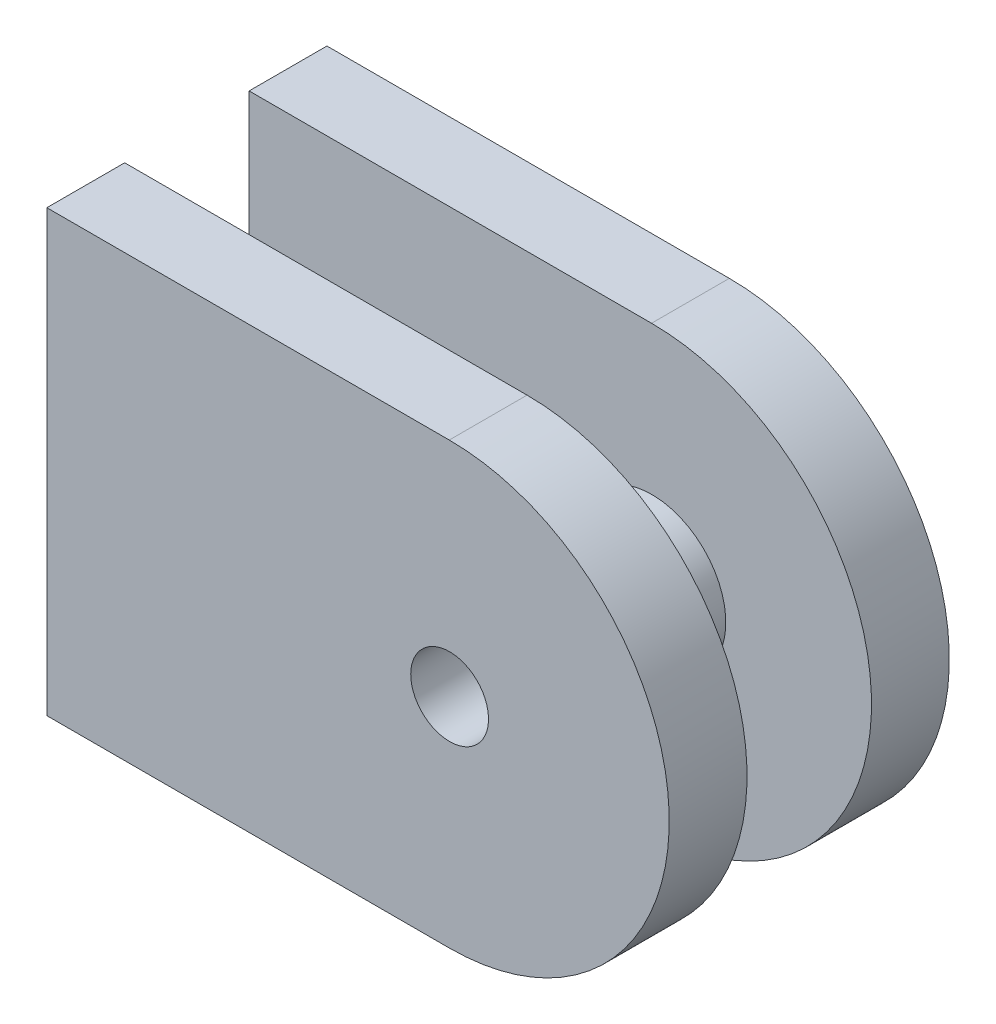
ISO-10303-21;
HEADER;
FILE_DESCRIPTION(('STEP AP214'),'2;1');
FILE_NAME('part.step','',(''),(''),'','','');
FILE_SCHEMA(('AUTOMOTIVE_DESIGN { 1 0 10303 214 1 1 1 1 }'));
ENDSEC;
DATA;
#1=APPLICATION_CONTEXT('core data for automotive mechanical design processes');
#2=APPLICATION_PROTOCOL_DEFINITION('international standard','automotive_design',2000,#1);
#3=PRODUCT_CONTEXT('',#1,'mechanical');
#4=PRODUCT('Part','Part','',(#3));
#5=PRODUCT_RELATED_PRODUCT_CATEGORY('part','',(#4));
#6=PRODUCT_DEFINITION_FORMATION('','',#4);
#7=PRODUCT_DEFINITION_CONTEXT('part definition',#1,'design');
#8=PRODUCT_DEFINITION('design','',#6,#7);
#9=PRODUCT_DEFINITION_SHAPE('','',#8);
#10=(LENGTH_UNIT() NAMED_UNIT(*) SI_UNIT(.MILLI.,.METRE.));
#11=(NAMED_UNIT(*) PLANE_ANGLE_UNIT() SI_UNIT($,.RADIAN.));
#12=(NAMED_UNIT(*) SI_UNIT($,.STERADIAN.) SOLID_ANGLE_UNIT());
#13=UNCERTAINTY_MEASURE_WITH_UNIT(LENGTH_MEASURE(1.E-05),#10,'distance_accuracy_value','');
#14=(GEOMETRIC_REPRESENTATION_CONTEXT(3) GLOBAL_UNCERTAINTY_ASSIGNED_CONTEXT((#13)) GLOBAL_UNIT_ASSIGNED_CONTEXT((#10,
#11,#12)) REPRESENTATION_CONTEXT('',''));
#15=CARTESIAN_POINT('',(0.,0.,0.));
#16=DIRECTION('',(0.,0.,1.));
#17=DIRECTION('',(1.,0.,0.));
#18=AXIS2_PLACEMENT_3D('',#15,#16,#17);
#19=CARTESIAN_POINT('',(0.,0.,5.));
#20=DIRECTION('',(1.,0.,0.));
#21=DIRECTION('',(0.,0.,-1.));
#22=AXIS2_PLACEMENT_3D('',#19,#20,#21);
#23=PLANE('',#22);
#24=DIRECTION('',(0.,-1.,0.));
#25=VECTOR('',#24,1.);
#26=CARTESIAN_POINT('',(0.,0.,5.));
#27=LINE('',#26,#25);
#28=CARTESIAN_POINT('',(0.,31.7713251901101,5.));
#29=VERTEX_POINT('',#28);
#30=CARTESIAN_POINT('',(0.,3.49668292914965,5.));
#31=VERTEX_POINT('',#30);
#32=EDGE_CURVE('E160',#29,#31,#27,.T.);
#33=ORIENTED_EDGE('',*,*,#32,.F.);
#34=DIRECTION('',(0.,0.,-1.));
#35=VECTOR('',#34,1.);
#36=CARTESIAN_POINT('',(0.,31.7713251901101,25.));
#37=LINE('',#36,#35);
#38=CARTESIAN_POINT('',(0.,31.7713251901101,0.));
#39=VERTEX_POINT('',#38);
#40=EDGE_CURVE('E131',#29,#39,#37,.T.);
#41=ORIENTED_EDGE('',*,*,#40,.T.);
#42=DIRECTION('',(0.,-1.,0.));
#43=VECTOR('',#42,1.);
#44=CARTESIAN_POINT('',(0.,0.,0.));
#45=LINE('',#44,#43);
#46=CARTESIAN_POINT('',(0.,3.49668292914966,0.));
#47=VERTEX_POINT('',#46);
#48=EDGE_CURVE('E159',#39,#47,#45,.T.);
#49=ORIENTED_EDGE('',*,*,#48,.T.);
#50=DIRECTION('',(0.,0.,-1.));
#51=VECTOR('',#50,1.);
#52=CARTESIAN_POINT('',(0.,3.49668292914965,25.));
#53=LINE('',#52,#51);
#54=EDGE_CURVE('E52',#31,#47,#53,.T.);
#55=ORIENTED_EDGE('',*,*,#54,.F.);
#56=EDGE_LOOP('',(#33,#41,#49,#55));
#57=FACE_BOUND('',#56,.T.);
#58=ADVANCED_FACE('F38',(#57),#23,.F.);
#59=CARTESIAN_POINT('',(0.,0.,5.));
#60=DIRECTION('',(0.,0.,-1.));
#61=DIRECTION('',(-1.,0.,0.));
#62=AXIS2_PLACEMENT_3D('',#59,#60,#61);
#63=PLANE('',#62);
#64=CARTESIAN_POINT('',(25.8853790283596,17.5,5.));
#65=DIRECTION('',(0.,0.,-1.));
#66=DIRECTION('',(-1.,0.,0.));
#67=AXIS2_PLACEMENT_3D('',#64,#65,#66);
#68=CIRCLE('',#67,4.75);
#69=CARTESIAN_POINT('',(21.1353790283596,17.5,5.));
#70=VERTEX_POINT('',#69);
#71=EDGE_CURVE('E163',#70,#70,#68,.F.);
#72=ORIENTED_EDGE('',*,*,#71,.F.);
#73=EDGE_LOOP('',(#72));
#74=FACE_BOUND('',#73,.T.);
#75=CARTESIAN_POINT('',(25.8626788695198,17.6340040596299,5.));
#76=DIRECTION('',(0.,0.,-1.));
#77=DIRECTION('',(-1.,0.,0.));
#78=AXIS2_PLACEMENT_3D('',#75,#76,#77);
#79=CIRCLE('',#78,14.1373211304802);
#80=CARTESIAN_POINT('',(25.8626788695198,3.49668292914966,5.));
#81=VERTEX_POINT('',#80);
#82=CARTESIAN_POINT('',(25.8626788695198,31.7713251901101,5.));
#83=VERTEX_POINT('',#82);
#84=EDGE_CURVE('E148',#81,#83,#79,.F.);
#85=ORIENTED_EDGE('',*,*,#84,.T.);
#86=DIRECTION('',(-1.,0.,0.));
#87=VECTOR('',#86,1.);
#88=CARTESIAN_POINT('',(0.,31.7713251901101,5.));
#89=LINE('',#88,#87);
#90=EDGE_CURVE('E113',#83,#29,#89,.T.);
#91=ORIENTED_EDGE('',*,*,#90,.T.);
#92=ORIENTED_EDGE('',*,*,#32,.T.);
#93=DIRECTION('',(1.,0.,0.));
#94=VECTOR('',#93,1.);
#95=CARTESIAN_POINT('',(0.,3.49668292914965,5.));
#96=LINE('',#95,#94);
#97=EDGE_CURVE('E139',#31,#81,#96,.T.);
#98=ORIENTED_EDGE('',*,*,#97,.T.);
#99=EDGE_LOOP('',(#85,#91,#92,#98));
#100=FACE_BOUND('',#99,.T.);
#101=ADVANCED_FACE('F194',(#74,#100),#63,.F.);
#102=CARTESIAN_POINT('',(0.,0.,0.));
#103=DIRECTION('',(0.,0.,-1.));
#104=DIRECTION('',(-1.,0.,0.));
#105=AXIS2_PLACEMENT_3D('',#102,#103,#104);
#106=PLANE('',#105);
#107=CARTESIAN_POINT('',(25.8853790283596,17.5,0.));
#108=DIRECTION('',(0.,0.,-1.));
#109=DIRECTION('',(-1.,0.,0.));
#110=AXIS2_PLACEMENT_3D('',#107,#108,#109);
#111=CIRCLE('',#110,2.5);
#112=CARTESIAN_POINT('',(23.3853790283596,17.5,0.));
#113=VERTEX_POINT('',#112);
#114=EDGE_CURVE('E225',#113,#113,#111,.T.);
#115=ORIENTED_EDGE('',*,*,#114,.F.);
#116=EDGE_LOOP('',(#115));
#117=FACE_BOUND('',#116,.T.);
#118=DIRECTION('',(-1.,0.,0.));
#119=VECTOR('',#118,1.);
#120=CARTESIAN_POINT('',(0.,31.7713251901101,0.));
#121=LINE('',#120,#119);
#122=CARTESIAN_POINT('',(25.8626788695198,31.7713251901101,0.));
#123=VERTEX_POINT('',#122);
#124=EDGE_CURVE('E143',#123,#39,#121,.T.);
#125=ORIENTED_EDGE('',*,*,#124,.F.);
#126=CARTESIAN_POINT('',(25.8626788695198,17.6340040596299,0.));
#127=DIRECTION('',(0.,0.,-1.));
#128=DIRECTION('',(-1.,0.,0.));
#129=AXIS2_PLACEMENT_3D('',#126,#127,#128);
#130=CIRCLE('',#129,14.1373211304802);
#131=CARTESIAN_POINT('',(25.8626788695198,3.49668292914966,0.));
#132=VERTEX_POINT('',#131);
#133=EDGE_CURVE('E112',#132,#123,#130,.F.);
#134=ORIENTED_EDGE('',*,*,#133,.F.);
#135=DIRECTION('',(1.,0.,0.));
#136=VECTOR('',#135,1.);
#137=CARTESIAN_POINT('',(0.,3.49668292914965,0.));
#138=LINE('',#137,#136);
#139=EDGE_CURVE('E118',#47,#132,#138,.T.);
#140=ORIENTED_EDGE('',*,*,#139,.F.);
#141=ORIENTED_EDGE('',*,*,#48,.F.);
#142=EDGE_LOOP('',(#125,#134,#140,#141));
#143=FACE_BOUND('',#142,.T.);
#144=ADVANCED_FACE('F199',(#117,#143),#106,.T.);
#145=CARTESIAN_POINT('',(25.8853790283596,17.5,13.));
#146=DIRECTION('',(0.,0.,-1.));
#147=DIRECTION('',(-1.,0.,0.));
#148=AXIS2_PLACEMENT_3D('',#145,#146,#147);
#149=CYLINDRICAL_SURFACE('',#148,4.75);
#150=CARTESIAN_POINT('',(25.8853790283596,17.5,13.));
#151=DIRECTION('',(0.,0.,1.));
#152=DIRECTION('',(1.,0.,0.));
#153=AXIS2_PLACEMENT_3D('',#150,#151,#152);
#154=CIRCLE('',#153,4.75);
#155=CARTESIAN_POINT('',(30.6353790283596,17.5,13.));
#156=VERTEX_POINT('',#155);
#157=EDGE_CURVE('E154',#156,#156,#154,.T.);
#158=ORIENTED_EDGE('',*,*,#157,.F.);
#159=EDGE_LOOP('',(#158));
#160=FACE_BOUND('',#159,.T.);
#161=ORIENTED_EDGE('',*,*,#71,.T.);
#162=EDGE_LOOP('',(#161));
#163=FACE_BOUND('',#162,.T.);
#164=ADVANCED_FACE('F228',(#160,#163),#149,.T.);
#165=CARTESIAN_POINT('',(0.,0.,13.));
#166=DIRECTION('',(1.,0.,0.));
#167=DIRECTION('',(0.,0.,1.));
#168=AXIS2_PLACEMENT_3D('',#165,#166,#167);
#169=PLANE('',#168);
#170=DIRECTION('',(0.,-1.,0.));
#171=VECTOR('',#170,1.);
#172=CARTESIAN_POINT('',(0.,0.,18.));
#173=LINE('',#172,#171);
#174=CARTESIAN_POINT('',(0.,31.7713251901101,18.));
#175=VERTEX_POINT('',#174);
#176=CARTESIAN_POINT('',(0.,3.49668292914965,18.));
#177=VERTEX_POINT('',#176);
#178=EDGE_CURVE('E151',#175,#177,#173,.T.);
#179=ORIENTED_EDGE('',*,*,#178,.F.);
#180=CARTESIAN_POINT('',(0.,31.7713251901101,13.));
#181=VERTEX_POINT('',#180);
#182=EDGE_CURVE('E134',#175,#181,#37,.T.);
#183=ORIENTED_EDGE('',*,*,#182,.T.);
#184=DIRECTION('',(0.,-1.,0.));
#185=VECTOR('',#184,1.);
#186=CARTESIAN_POINT('',(0.,0.,13.));
#187=LINE('',#186,#185);
#188=CARTESIAN_POINT('',(0.,3.49668292914965,13.));
#189=VERTEX_POINT('',#188);
#190=EDGE_CURVE('E152',#181,#189,#187,.T.);
#191=ORIENTED_EDGE('',*,*,#190,.T.);
#192=EDGE_CURVE('E117',#177,#189,#53,.T.);
#193=ORIENTED_EDGE('',*,*,#192,.F.);
#194=EDGE_LOOP('',(#179,#183,#191,#193));
#195=FACE_BOUND('',#194,.T.);
#196=ADVANCED_FACE('F172',(#195),#169,.F.);
#197=CARTESIAN_POINT('',(0.,0.,13.));
#198=DIRECTION('',(0.,0.,1.));
#199=DIRECTION('',(-1.,0.,0.));
#200=AXIS2_PLACEMENT_3D('',#197,#198,#199);
#201=PLANE('',#200);
#202=ORIENTED_EDGE('',*,*,#157,.T.);
#203=EDGE_LOOP('',(#202));
#204=FACE_BOUND('',#203,.T.);
#205=ORIENTED_EDGE('',*,*,#190,.F.);
#206=DIRECTION('',(1.,0.,0.));
#207=VECTOR('',#206,1.);
#208=CARTESIAN_POINT('',(0.,31.7713251901101,13.));
#209=LINE('',#208,#207);
#210=CARTESIAN_POINT('',(25.8626788695198,31.7713251901101,13.));
#211=VERTEX_POINT('',#210);
#212=EDGE_CURVE('E108',#181,#211,#209,.T.);
#213=ORIENTED_EDGE('',*,*,#212,.T.);
#214=CARTESIAN_POINT('',(25.8626788695198,17.6340040596299,13.));
#215=DIRECTION('',(0.,0.,1.));
#216=DIRECTION('',(1.,0.,0.));
#217=AXIS2_PLACEMENT_3D('',#214,#215,#216);
#218=CIRCLE('',#217,14.1373211304802);
#219=CARTESIAN_POINT('',(25.8626788695198,3.49668292914966,13.));
#220=VERTEX_POINT('',#219);
#221=EDGE_CURVE('E103',#211,#220,#218,.F.);
#222=ORIENTED_EDGE('',*,*,#221,.T.);
#223=DIRECTION('',(-1.,0.,0.));
#224=VECTOR('',#223,1.);
#225=CARTESIAN_POINT('',(0.,3.49668292914965,13.));
#226=LINE('',#225,#224);
#227=EDGE_CURVE('E106',#220,#189,#226,.T.);
#228=ORIENTED_EDGE('',*,*,#227,.T.);
#229=EDGE_LOOP('',(#205,#213,#222,#228));
#230=FACE_BOUND('',#229,.T.);
#231=ADVANCED_FACE('F105',(#204,#230),#201,.F.);
#232=CARTESIAN_POINT('',(0.,0.,18.));
#233=DIRECTION('',(0.,0.,1.));
#234=DIRECTION('',(-1.,0.,0.));
#235=AXIS2_PLACEMENT_3D('',#232,#233,#234);
#236=PLANE('',#235);
#237=CARTESIAN_POINT('',(25.8853790283596,17.5,18.));
#238=DIRECTION('',(0.,0.,-1.));
#239=DIRECTION('',(-1.,0.,0.));
#240=AXIS2_PLACEMENT_3D('',#237,#238,#239);
#241=CIRCLE('',#240,2.5);
#242=CARTESIAN_POINT('',(23.3853790283596,17.5,18.));
#243=VERTEX_POINT('',#242);
#244=EDGE_CURVE('E127',#243,#243,#241,.T.);
#245=ORIENTED_EDGE('',*,*,#244,.T.);
#246=EDGE_LOOP('',(#245));
#247=FACE_BOUND('',#246,.T.);
#248=DIRECTION('',(1.,0.,0.));
#249=VECTOR('',#248,1.);
#250=CARTESIAN_POINT('',(0.,31.7713251901101,18.));
#251=LINE('',#250,#249);
#252=CARTESIAN_POINT('',(25.8626788695198,31.7713251901101,18.));
#253=VERTEX_POINT('',#252);
#254=EDGE_CURVE('E12',#175,#253,#251,.T.);
#255=ORIENTED_EDGE('',*,*,#254,.F.);
#256=ORIENTED_EDGE('',*,*,#178,.T.);
#257=DIRECTION('',(-1.,0.,0.));
#258=VECTOR('',#257,1.);
#259=CARTESIAN_POINT('',(0.,3.49668292914965,18.));
#260=LINE('',#259,#258);
#261=CARTESIAN_POINT('',(25.8626788695198,3.49668292914966,18.));
#262=VERTEX_POINT('',#261);
#263=EDGE_CURVE('E168',#262,#177,#260,.T.);
#264=ORIENTED_EDGE('',*,*,#263,.F.);
#265=CARTESIAN_POINT('',(25.8626788695198,17.6340040596299,18.));
#266=DIRECTION('',(0.,0.,1.));
#267=DIRECTION('',(1.,0.,0.));
#268=AXIS2_PLACEMENT_3D('',#265,#266,#267);
#269=CIRCLE('',#268,14.1373211304802);
#270=EDGE_CURVE('E45',#253,#262,#269,.F.);
#271=ORIENTED_EDGE('',*,*,#270,.F.);
#272=EDGE_LOOP('',(#255,#256,#264,#271));
#273=FACE_BOUND('',#272,.T.);
#274=ADVANCED_FACE('F175',(#247,#273),#236,.T.);
#275=CARTESIAN_POINT('',(25.8626788695198,31.7713251901101,25.));
#276=DIRECTION('',(0.,-1.,0.));
#277=DIRECTION('',(0.,0.,-1.));
#278=AXIS2_PLACEMENT_3D('',#275,#276,#277);
#279=PLANE('',#278);
#280=ORIENTED_EDGE('',*,*,#182,.F.);
#281=ORIENTED_EDGE('',*,*,#254,.T.);
#282=DIRECTION('',(0.,0.,-1.));
#283=VECTOR('',#282,1.);
#284=CARTESIAN_POINT('',(25.8626788695198,31.7713251901101,25.));
#285=LINE('',#284,#283);
#286=EDGE_CURVE('E119',#253,#211,#285,.T.);
#287=ORIENTED_EDGE('',*,*,#286,.T.);
#288=ORIENTED_EDGE('',*,*,#212,.F.);
#289=EDGE_LOOP('',(#280,#281,#287,#288));
#290=FACE_BOUND('',#289,.T.);
#291=ADVANCED_FACE('F177',(#290),#279,.F.);
#292=CARTESIAN_POINT('',(25.8626788695198,3.49668292914966,25.));
#293=DIRECTION('',(0.,1.,0.));
#294=DIRECTION('',(-1.,0.,0.));
#295=AXIS2_PLACEMENT_3D('',#292,#293,#294);
#296=PLANE('',#295);
#297=DIRECTION('',(0.,0.,-1.));
#298=VECTOR('',#297,1.);
#299=CARTESIAN_POINT('',(25.8626788695198,3.49668292914966,25.));
#300=LINE('',#299,#298);
#301=EDGE_CURVE('E60',#262,#220,#300,.T.);
#302=ORIENTED_EDGE('',*,*,#301,.F.);
#303=ORIENTED_EDGE('',*,*,#263,.T.);
#304=ORIENTED_EDGE('',*,*,#192,.T.);
#305=ORIENTED_EDGE('',*,*,#227,.F.);
#306=EDGE_LOOP('',(#302,#303,#304,#305));
#307=FACE_BOUND('',#306,.T.);
#308=ADVANCED_FACE('F115',(#307),#296,.F.);
#309=CARTESIAN_POINT('',(25.8626788695198,17.6340040596299,25.));
#310=DIRECTION('',(0.,0.,-1.));
#311=DIRECTION('',(-1.,0.,0.));
#312=AXIS2_PLACEMENT_3D('',#309,#310,#311);
#313=CYLINDRICAL_SURFACE('',#312,14.1373211304802);
#314=ORIENTED_EDGE('',*,*,#221,.F.);
#315=ORIENTED_EDGE('',*,*,#286,.F.);
#316=ORIENTED_EDGE('',*,*,#270,.T.);
#317=ORIENTED_EDGE('',*,*,#301,.T.);
#318=EDGE_LOOP('',(#314,#315,#316,#317));
#319=FACE_BOUND('',#318,.T.);
#320=ADVANCED_FACE('F121',(#319),#313,.T.);
#321=ORIENTED_EDGE('',*,*,#133,.T.);
#322=EDGE_CURVE('E135',#83,#123,#285,.T.);
#323=ORIENTED_EDGE('',*,*,#322,.F.);
#324=ORIENTED_EDGE('',*,*,#84,.F.);
#325=EDGE_CURVE('E123',#81,#132,#300,.T.);
#326=ORIENTED_EDGE('',*,*,#325,.T.);
#327=EDGE_LOOP('',(#321,#323,#324,#326));
#328=FACE_BOUND('',#327,.T.);
#329=ADVANCED_FACE('F191',(#328),#313,.T.);
#330=ORIENTED_EDGE('',*,*,#322,.T.);
#331=ORIENTED_EDGE('',*,*,#124,.T.);
#332=ORIENTED_EDGE('',*,*,#40,.F.);
#333=ORIENTED_EDGE('',*,*,#90,.F.);
#334=EDGE_LOOP('',(#330,#331,#332,#333));
#335=FACE_BOUND('',#334,.T.);
#336=ADVANCED_FACE('F180',(#335),#279,.F.);
#337=ORIENTED_EDGE('',*,*,#54,.T.);
#338=ORIENTED_EDGE('',*,*,#139,.T.);
#339=ORIENTED_EDGE('',*,*,#325,.F.);
#340=ORIENTED_EDGE('',*,*,#97,.F.);
#341=EDGE_LOOP('',(#337,#338,#339,#340));
#342=FACE_BOUND('',#341,.T.);
#343=ADVANCED_FACE('F186',(#342),#296,.F.);
#344=CARTESIAN_POINT('',(25.8853790283596,17.5,0.));
#345=DIRECTION('',(0.,0.,-1.));
#346=DIRECTION('',(-1.,0.,0.));
#347=AXIS2_PLACEMENT_3D('',#344,#345,#346);
#348=CYLINDRICAL_SURFACE('',#347,2.5);
#349=ORIENTED_EDGE('',*,*,#244,.F.);
#350=EDGE_LOOP('',(#349));
#351=FACE_BOUND('',#350,.T.);
#352=ORIENTED_EDGE('',*,*,#114,.T.);
#353=EDGE_LOOP('',(#352));
#354=FACE_BOUND('',#353,.T.);
#355=ADVANCED_FACE('F212',(#351,#354),#348,.F.);
#356=CLOSED_SHELL('',(#58,#101,#144,#164,#196,#231,#274,#291,#308,#320,#329,#336,#343,#355));
#357=MANIFOLD_SOLID_BREP('B2',#356);
#358=ADVANCED_BREP_SHAPE_REPRESENTATION('',(#18,#357),#14);
#359=SHAPE_DEFINITION_REPRESENTATION(#9,#358);
ENDSEC;
END-ISO-10303-21;
